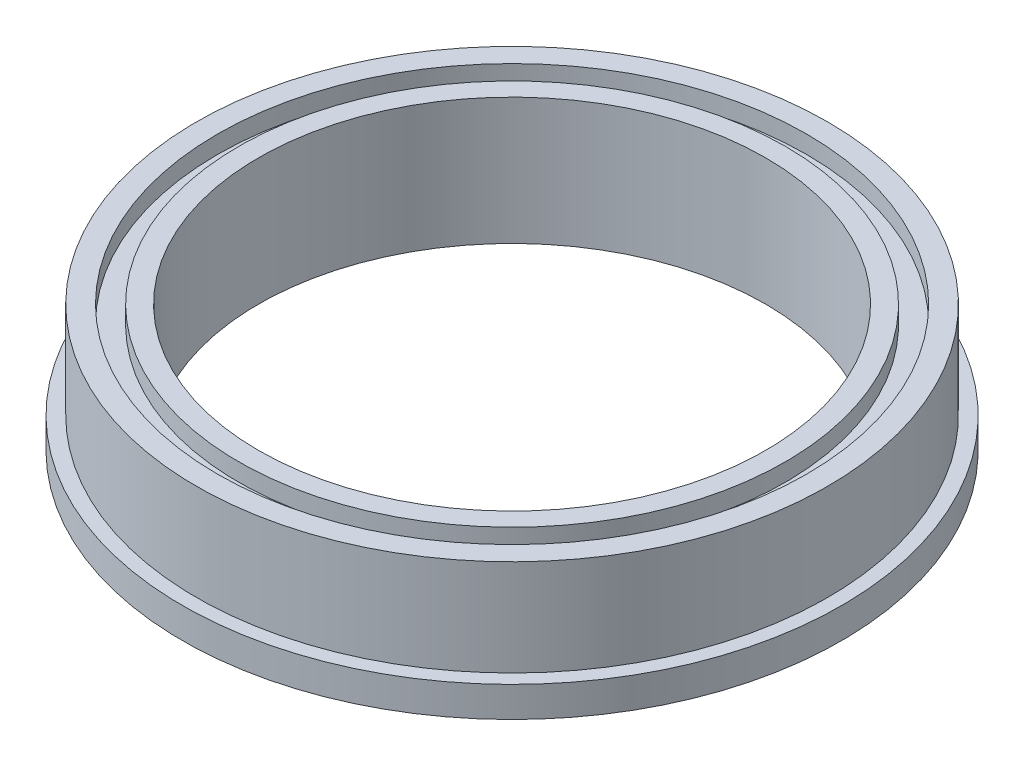
ISO-10303-21;
HEADER;
FILE_DESCRIPTION(('STEP AP214'),'2;1');
FILE_NAME('part.step','',(''),(''),'','','');
FILE_SCHEMA(('AUTOMOTIVE_DESIGN { 1 0 10303 214 1 1 1 1 }'));
ENDSEC;
DATA;
#1=APPLICATION_CONTEXT('core data for automotive mechanical design processes');
#2=APPLICATION_PROTOCOL_DEFINITION('international standard','automotive_design',2000,#1);
#3=PRODUCT_CONTEXT('',#1,'mechanical');
#4=PRODUCT('Part','Part','',(#3));
#5=PRODUCT_RELATED_PRODUCT_CATEGORY('part','',(#4));
#6=PRODUCT_DEFINITION_FORMATION('','',#4);
#7=PRODUCT_DEFINITION_CONTEXT('part definition',#1,'design');
#8=PRODUCT_DEFINITION('design','',#6,#7);
#9=PRODUCT_DEFINITION_SHAPE('','',#8);
#10=(LENGTH_UNIT() NAMED_UNIT(*) SI_UNIT(.MILLI.,.METRE.));
#11=(NAMED_UNIT(*) PLANE_ANGLE_UNIT() SI_UNIT($,.RADIAN.));
#12=(NAMED_UNIT(*) SI_UNIT($,.STERADIAN.) SOLID_ANGLE_UNIT());
#13=UNCERTAINTY_MEASURE_WITH_UNIT(LENGTH_MEASURE(1.E-05),#10,'distance_accuracy_value','');
#14=(GEOMETRIC_REPRESENTATION_CONTEXT(3) GLOBAL_UNCERTAINTY_ASSIGNED_CONTEXT((#13)) GLOBAL_UNIT_ASSIGNED_CONTEXT((#10,
#11,#12)) REPRESENTATION_CONTEXT('',''));
#15=CARTESIAN_POINT('',(0.,0.,0.));
#16=DIRECTION('',(0.,0.,1.));
#17=DIRECTION('',(1.,0.,0.));
#18=AXIS2_PLACEMENT_3D('',#15,#16,#17);
#19=CARTESIAN_POINT('',(14.7574,0.,0.));
#20=DIRECTION('',(0.,-1.,0.));
#21=DIRECTION('',(0.,0.,-1.));
#22=AXIS2_PLACEMENT_3D('',#19,#20,#21);
#23=PLANE('',#22);
#24=CARTESIAN_POINT('',(0.,0.,0.));
#25=DIRECTION('',(0.,-1.,0.));
#26=DIRECTION('',(0.,0.,-1.));
#27=AXIS2_PLACEMENT_3D('',#24,#25,#26);
#28=CIRCLE('',#27,16.51);
#29=CARTESIAN_POINT('',(0.,0.,-16.51));
#30=VERTEX_POINT('',#29);
#31=EDGE_CURVE('E10',#30,#30,#28,.T.);
#32=ORIENTED_EDGE('',*,*,#31,.T.);
#33=EDGE_LOOP('',(#32));
#34=FACE_BOUND('',#33,.T.);
#35=CARTESIAN_POINT('',(0.,0.,0.));
#36=DIRECTION('',(0.,-1.,0.));
#37=DIRECTION('',(0.,0.,-1.));
#38=AXIS2_PLACEMENT_3D('',#35,#36,#37);
#39=CIRCLE('',#38,14.7574);
#40=CARTESIAN_POINT('',(0.,0.,-14.7574));
#41=VERTEX_POINT('',#40);
#42=EDGE_CURVE('E79',#41,#41,#39,.T.);
#43=ORIENTED_EDGE('',*,*,#42,.F.);
#44=EDGE_LOOP('',(#43));
#45=FACE_BOUND('',#44,.T.);
#46=ADVANCED_FACE('F33',(#34,#45),#23,.T.);
#47=CARTESIAN_POINT('',(0.,6.35,0.));
#48=DIRECTION('',(0.,-1.,0.));
#49=DIRECTION('',(0.,0.,-1.));
#50=AXIS2_PLACEMENT_3D('',#47,#48,#49);
#51=CYLINDRICAL_SURFACE('',#50,16.51);
#52=CARTESIAN_POINT('',(0.,1.524,0.));
#53=DIRECTION('',(0.,-1.,0.));
#54=DIRECTION('',(0.,0.,-1.));
#55=AXIS2_PLACEMENT_3D('',#52,#53,#54);
#56=CIRCLE('',#55,16.51);
#57=CARTESIAN_POINT('',(0.,1.524,-16.51));
#58=VERTEX_POINT('',#57);
#59=EDGE_CURVE('E39',#58,#58,#56,.T.);
#60=ORIENTED_EDGE('',*,*,#59,.T.);
#61=EDGE_LOOP('',(#60));
#62=FACE_BOUND('',#61,.T.);
#63=ORIENTED_EDGE('',*,*,#31,.F.);
#64=EDGE_LOOP('',(#63));
#65=FACE_BOUND('',#64,.T.);
#66=ADVANCED_FACE('F87',(#62,#65),#51,.T.);
#67=CARTESIAN_POINT('',(16.51,1.524,0.));
#68=DIRECTION('',(0.,1.,0.));
#69=DIRECTION('',(0.,0.,1.));
#70=AXIS2_PLACEMENT_3D('',#67,#68,#69);
#71=PLANE('',#70);
#72=CARTESIAN_POINT('',(0.,1.524,0.));
#73=DIRECTION('',(0.,-1.,0.));
#74=DIRECTION('',(0.,0.,-1.));
#75=AXIS2_PLACEMENT_3D('',#72,#73,#74);
#76=CIRCLE('',#75,15.8115);
#77=CARTESIAN_POINT('',(0.,1.524,-15.8115));
#78=VERTEX_POINT('',#77);
#79=EDGE_CURVE('E43',#78,#78,#76,.T.);
#80=ORIENTED_EDGE('',*,*,#79,.T.);
#81=EDGE_LOOP('',(#80));
#82=FACE_BOUND('',#81,.T.);
#83=ORIENTED_EDGE('',*,*,#59,.F.);
#84=EDGE_LOOP('',(#83));
#85=FACE_BOUND('',#84,.T.);
#86=ADVANCED_FACE('F91',(#82,#85),#71,.T.);
#87=CARTESIAN_POINT('',(0.,6.35,0.));
#88=DIRECTION('',(0.,-1.,0.));
#89=DIRECTION('',(0.,0.,-1.));
#90=AXIS2_PLACEMENT_3D('',#87,#88,#89);
#91=CYLINDRICAL_SURFACE('',#90,15.8115);
#92=CARTESIAN_POINT('',(0.,6.35,0.));
#93=DIRECTION('',(0.,-1.,0.));
#94=DIRECTION('',(0.,0.,-1.));
#95=AXIS2_PLACEMENT_3D('',#92,#93,#94);
#96=CIRCLE('',#95,15.8115);
#97=CARTESIAN_POINT('',(0.,6.35,-15.8115));
#98=VERTEX_POINT('',#97);
#99=EDGE_CURVE('E47',#98,#98,#96,.T.);
#100=ORIENTED_EDGE('',*,*,#99,.T.);
#101=EDGE_LOOP('',(#100));
#102=FACE_BOUND('',#101,.T.);
#103=ORIENTED_EDGE('',*,*,#79,.F.);
#104=EDGE_LOOP('',(#103));
#105=FACE_BOUND('',#104,.T.);
#106=ADVANCED_FACE('F95',(#102,#105),#91,.T.);
#107=CARTESIAN_POINT('',(15.8115,6.35,0.));
#108=DIRECTION('',(0.,1.,0.));
#109=DIRECTION('',(0.,0.,1.));
#110=AXIS2_PLACEMENT_3D('',#107,#108,#109);
#111=PLANE('',#110);
#112=CARTESIAN_POINT('',(0.,6.35,0.));
#113=DIRECTION('',(0.,-1.,0.));
#114=DIRECTION('',(0.,0.,-1.));
#115=AXIS2_PLACEMENT_3D('',#112,#113,#114);
#116=CIRCLE('',#115,14.7574);
#117=CARTESIAN_POINT('',(0.,6.35,-14.7574));
#118=VERTEX_POINT('',#117);
#119=EDGE_CURVE('E52',#118,#118,#116,.T.);
#120=ORIENTED_EDGE('',*,*,#119,.T.);
#121=EDGE_LOOP('',(#120));
#122=FACE_BOUND('',#121,.T.);
#123=ORIENTED_EDGE('',*,*,#99,.F.);
#124=EDGE_LOOP('',(#123));
#125=FACE_BOUND('',#124,.T.);
#126=ADVANCED_FACE('F102',(#122,#125),#111,.T.);
#127=CARTESIAN_POINT('',(0.,6.35,0.));
#128=DIRECTION('',(0.,-1.,0.));
#129=DIRECTION('',(0.,0.,-1.));
#130=AXIS2_PLACEMENT_3D('',#127,#128,#129);
#131=CYLINDRICAL_SURFACE('',#130,14.7574);
#132=CARTESIAN_POINT('',(0.,5.461,0.));
#133=DIRECTION('',(0.,-1.,0.));
#134=DIRECTION('',(0.,0.,-1.));
#135=AXIS2_PLACEMENT_3D('',#132,#133,#134);
#136=CIRCLE('',#135,14.7574);
#137=CARTESIAN_POINT('',(0.,5.461,-14.7574));
#138=VERTEX_POINT('',#137);
#139=EDGE_CURVE('E55',#138,#138,#136,.T.);
#140=ORIENTED_EDGE('',*,*,#139,.T.);
#141=EDGE_LOOP('',(#140));
#142=FACE_BOUND('',#141,.T.);
#143=ORIENTED_EDGE('',*,*,#119,.F.);
#144=EDGE_LOOP('',(#143));
#145=FACE_BOUND('',#144,.T.);
#146=ADVANCED_FACE('F106',(#142,#145),#131,.F.);
#147=CARTESIAN_POINT('',(14.7574,5.461,0.));
#148=DIRECTION('',(0.,1.,0.));
#149=DIRECTION('',(0.,0.,1.));
#150=AXIS2_PLACEMENT_3D('',#147,#148,#149);
#151=PLANE('',#150);
#152=CARTESIAN_POINT('',(0.,5.461,0.));
#153=DIRECTION('',(0.,-1.,0.));
#154=DIRECTION('',(0.,0.,-1.));
#155=AXIS2_PLACEMENT_3D('',#152,#153,#154);
#156=CIRCLE('',#155,13.6906);
#157=CARTESIAN_POINT('',(0.,5.461,-13.6906));
#158=VERTEX_POINT('',#157);
#159=EDGE_CURVE('E58',#158,#158,#156,.T.);
#160=ORIENTED_EDGE('',*,*,#159,.T.);
#161=EDGE_LOOP('',(#160));
#162=FACE_BOUND('',#161,.T.);
#163=ORIENTED_EDGE('',*,*,#139,.F.);
#164=EDGE_LOOP('',(#163));
#165=FACE_BOUND('',#164,.T.);
#166=ADVANCED_FACE('F110',(#162,#165),#151,.T.);
#167=CARTESIAN_POINT('',(0.,6.35,0.));
#168=DIRECTION('',(0.,-1.,0.));
#169=DIRECTION('',(0.,0.,-1.));
#170=AXIS2_PLACEMENT_3D('',#167,#168,#169);
#171=CYLINDRICAL_SURFACE('',#170,13.6906);
#172=CARTESIAN_POINT('',(0.,6.35,0.));
#173=DIRECTION('',(0.,-1.,0.));
#174=DIRECTION('',(0.,0.,-1.));
#175=AXIS2_PLACEMENT_3D('',#172,#173,#174);
#176=CIRCLE('',#175,13.6906);
#177=CARTESIAN_POINT('',(0.,6.35,-13.6906));
#178=VERTEX_POINT('',#177);
#179=EDGE_CURVE('E61',#178,#178,#176,.T.);
#180=ORIENTED_EDGE('',*,*,#179,.T.);
#181=EDGE_LOOP('',(#180));
#182=FACE_BOUND('',#181,.T.);
#183=ORIENTED_EDGE('',*,*,#159,.F.);
#184=EDGE_LOOP('',(#183));
#185=FACE_BOUND('',#184,.T.);
#186=ADVANCED_FACE('F114',(#182,#185),#171,.T.);
#187=CARTESIAN_POINT('',(13.6906,6.35,0.));
#188=DIRECTION('',(0.,1.,0.));
#189=DIRECTION('',(0.,0.,1.));
#190=AXIS2_PLACEMENT_3D('',#187,#188,#189);
#191=PLANE('',#190);
#192=CARTESIAN_POINT('',(0.,6.35,0.));
#193=DIRECTION('',(0.,-1.,0.));
#194=DIRECTION('',(0.,0.,-1.));
#195=AXIS2_PLACEMENT_3D('',#192,#193,#194);
#196=CIRCLE('',#195,12.7);
#197=CARTESIAN_POINT('',(0.,6.35,-12.7));
#198=VERTEX_POINT('',#197);
#199=EDGE_CURVE('E64',#198,#198,#196,.T.);
#200=ORIENTED_EDGE('',*,*,#199,.T.);
#201=EDGE_LOOP('',(#200));
#202=FACE_BOUND('',#201,.T.);
#203=ORIENTED_EDGE('',*,*,#179,.F.);
#204=EDGE_LOOP('',(#203));
#205=FACE_BOUND('',#204,.T.);
#206=ADVANCED_FACE('F118',(#202,#205),#191,.T.);
#207=CARTESIAN_POINT('',(0.,6.35,0.));
#208=DIRECTION('',(0.,-1.,0.));
#209=DIRECTION('',(0.,0.,-1.));
#210=AXIS2_PLACEMENT_3D('',#207,#208,#209);
#211=CYLINDRICAL_SURFACE('',#210,12.7);
#212=CARTESIAN_POINT('',(0.,0.,0.));
#213=DIRECTION('',(0.,-1.,0.));
#214=DIRECTION('',(0.,0.,-1.));
#215=AXIS2_PLACEMENT_3D('',#212,#213,#214);
#216=CIRCLE('',#215,12.7);
#217=CARTESIAN_POINT('',(0.,0.,-12.7));
#218=VERTEX_POINT('',#217);
#219=EDGE_CURVE('E67',#218,#218,#216,.T.);
#220=ORIENTED_EDGE('',*,*,#219,.T.);
#221=EDGE_LOOP('',(#220));
#222=FACE_BOUND('',#221,.T.);
#223=ORIENTED_EDGE('',*,*,#199,.F.);
#224=EDGE_LOOP('',(#223));
#225=FACE_BOUND('',#224,.T.);
#226=ADVANCED_FACE('F122',(#222,#225),#211,.F.);
#227=CARTESIAN_POINT('',(12.7,0.,0.));
#228=DIRECTION('',(0.,-1.,0.));
#229=DIRECTION('',(0.,0.,-1.));
#230=AXIS2_PLACEMENT_3D('',#227,#228,#229);
#231=PLANE('',#230);
#232=CARTESIAN_POINT('',(0.,0.,0.));
#233=DIRECTION('',(0.,-1.,0.));
#234=DIRECTION('',(0.,0.,-1.));
#235=AXIS2_PLACEMENT_3D('',#232,#233,#234);
#236=CIRCLE('',#235,13.6906);
#237=CARTESIAN_POINT('',(0.,0.,-13.6906));
#238=VERTEX_POINT('',#237);
#239=EDGE_CURVE('E70',#238,#238,#236,.T.);
#240=ORIENTED_EDGE('',*,*,#239,.T.);
#241=EDGE_LOOP('',(#240));
#242=FACE_BOUND('',#241,.T.);
#243=ORIENTED_EDGE('',*,*,#219,.F.);
#244=EDGE_LOOP('',(#243));
#245=FACE_BOUND('',#244,.T.);
#246=ADVANCED_FACE('F126',(#242,#245),#231,.T.);
#247=CARTESIAN_POINT('',(0.,6.35,0.));
#248=DIRECTION('',(0.,-1.,0.));
#249=DIRECTION('',(0.,0.,-1.));
#250=AXIS2_PLACEMENT_3D('',#247,#248,#249);
#251=CYLINDRICAL_SURFACE('',#250,13.6906);
#252=CARTESIAN_POINT('',(0.,0.889,0.));
#253=DIRECTION('',(0.,-1.,0.));
#254=DIRECTION('',(0.,0.,-1.));
#255=AXIS2_PLACEMENT_3D('',#252,#253,#254);
#256=CIRCLE('',#255,13.6906);
#257=CARTESIAN_POINT('',(0.,0.889,-13.6906));
#258=VERTEX_POINT('',#257);
#259=EDGE_CURVE('E73',#258,#258,#256,.T.);
#260=ORIENTED_EDGE('',*,*,#259,.T.);
#261=EDGE_LOOP('',(#260));
#262=FACE_BOUND('',#261,.T.);
#263=ORIENTED_EDGE('',*,*,#239,.F.);
#264=EDGE_LOOP('',(#263));
#265=FACE_BOUND('',#264,.T.);
#266=ADVANCED_FACE('F130',(#262,#265),#251,.T.);
#267=CARTESIAN_POINT('',(13.6906,0.889,0.));
#268=DIRECTION('',(0.,-1.,0.));
#269=DIRECTION('',(0.,0.,-1.));
#270=AXIS2_PLACEMENT_3D('',#267,#268,#269);
#271=PLANE('',#270);
#272=CARTESIAN_POINT('',(0.,0.889,0.));
#273=DIRECTION('',(0.,-1.,0.));
#274=DIRECTION('',(0.,0.,-1.));
#275=AXIS2_PLACEMENT_3D('',#272,#273,#274);
#276=CIRCLE('',#275,14.7574);
#277=CARTESIAN_POINT('',(0.,0.889,-14.7574));
#278=VERTEX_POINT('',#277);
#279=EDGE_CURVE('E76',#278,#278,#276,.T.);
#280=ORIENTED_EDGE('',*,*,#279,.T.);
#281=EDGE_LOOP('',(#280));
#282=FACE_BOUND('',#281,.T.);
#283=ORIENTED_EDGE('',*,*,#259,.F.);
#284=EDGE_LOOP('',(#283));
#285=FACE_BOUND('',#284,.T.);
#286=ADVANCED_FACE('F134',(#282,#285),#271,.T.);
#287=CARTESIAN_POINT('',(0.,6.35,0.));
#288=DIRECTION('',(0.,-1.,0.));
#289=DIRECTION('',(0.,0.,-1.));
#290=AXIS2_PLACEMENT_3D('',#287,#288,#289);
#291=CYLINDRICAL_SURFACE('',#290,14.7574);
#292=ORIENTED_EDGE('',*,*,#42,.T.);
#293=EDGE_LOOP('',(#292));
#294=FACE_BOUND('',#293,.T.);
#295=ORIENTED_EDGE('',*,*,#279,.F.);
#296=EDGE_LOOP('',(#295));
#297=FACE_BOUND('',#296,.T.);
#298=ADVANCED_FACE('F83',(#294,#297),#291,.F.);
#299=CLOSED_SHELL('',(#46,#66,#86,#106,#126,#146,#166,#186,#206,#226,#246,#266,#286,#298));
#300=MANIFOLD_SOLID_BREP('B2',#299);
#301=ADVANCED_BREP_SHAPE_REPRESENTATION('',(#18,#300),#14);
#302=SHAPE_DEFINITION_REPRESENTATION(#9,#301);
ENDSEC;
END-ISO-10303-21;
